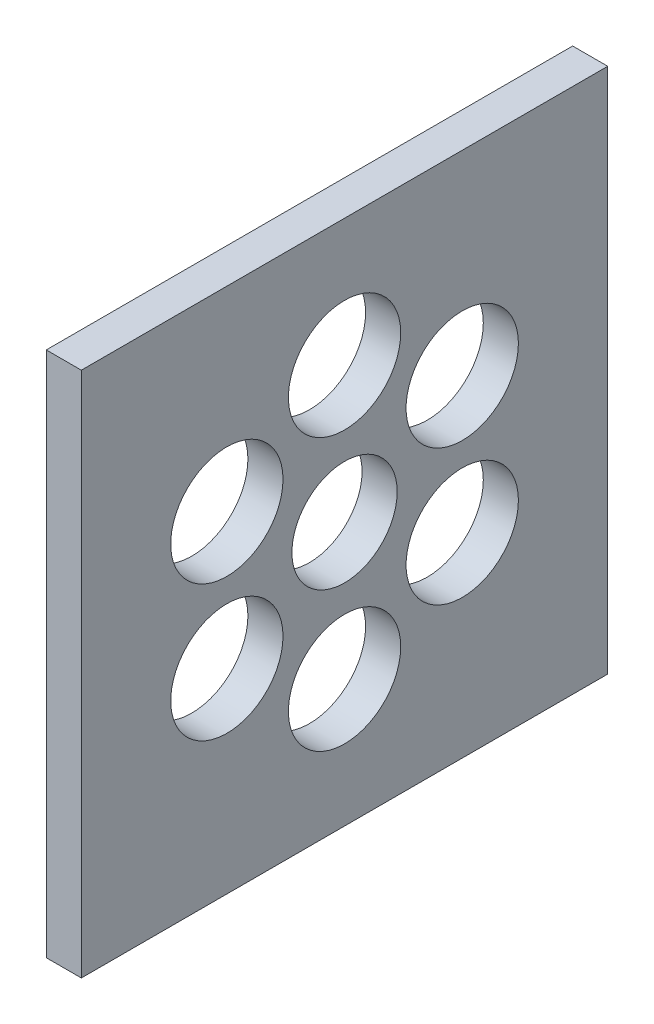
ISO-10303-21;
HEADER;
FILE_DESCRIPTION(('STEP AP214'),'2;1');
FILE_NAME('part.step','',(''),(''),'','','');
FILE_SCHEMA(('AUTOMOTIVE_DESIGN { 1 0 10303 214 1 1 1 1 }'));
ENDSEC;
DATA;
#1=APPLICATION_CONTEXT('core data for automotive mechanical design processes');
#2=APPLICATION_PROTOCOL_DEFINITION('international standard','automotive_design',2000,#1);
#3=PRODUCT_CONTEXT('',#1,'mechanical');
#4=PRODUCT('Part','Part','',(#3));
#5=PRODUCT_RELATED_PRODUCT_CATEGORY('part','',(#4));
#6=PRODUCT_DEFINITION_FORMATION('','',#4);
#7=PRODUCT_DEFINITION_CONTEXT('part definition',#1,'design');
#8=PRODUCT_DEFINITION('design','',#6,#7);
#9=PRODUCT_DEFINITION_SHAPE('','',#8);
#10=(LENGTH_UNIT() NAMED_UNIT(*) SI_UNIT(.MILLI.,.METRE.));
#11=(NAMED_UNIT(*) PLANE_ANGLE_UNIT() SI_UNIT($,.RADIAN.));
#12=(NAMED_UNIT(*) SI_UNIT($,.STERADIAN.) SOLID_ANGLE_UNIT());
#13=UNCERTAINTY_MEASURE_WITH_UNIT(LENGTH_MEASURE(1.E-05),#10,'distance_accuracy_value','');
#14=(GEOMETRIC_REPRESENTATION_CONTEXT(3) GLOBAL_UNCERTAINTY_ASSIGNED_CONTEXT((#13)) GLOBAL_UNIT_ASSIGNED_CONTEXT((#10,
#11,#12)) REPRESENTATION_CONTEXT('',''));
#15=CARTESIAN_POINT('',(0.,0.,0.));
#16=DIRECTION('',(0.,0.,1.));
#17=DIRECTION('',(1.,0.,0.));
#18=AXIS2_PLACEMENT_3D('',#15,#16,#17);
#19=CARTESIAN_POINT('',(10.,75.,-75.));
#20=DIRECTION('',(0.,0.,1.));
#21=DIRECTION('',(0.,-1.,0.));
#22=AXIS2_PLACEMENT_3D('',#19,#20,#21);
#23=PLANE('',#22);
#24=DIRECTION('',(0.,1.,0.));
#25=VECTOR('',#24,1.);
#26=CARTESIAN_POINT('',(0.,75.,-75.));
#27=LINE('',#26,#25);
#28=CARTESIAN_POINT('',(0.,-75.,-75.));
#29=VERTEX_POINT('',#28);
#30=CARTESIAN_POINT('',(0.,75.,-75.));
#31=VERTEX_POINT('',#30);
#32=EDGE_CURVE('E99',#29,#31,#27,.T.);
#33=ORIENTED_EDGE('',*,*,#32,.T.);
#34=DIRECTION('',(-1.,0.,0.));
#35=VECTOR('',#34,1.);
#36=CARTESIAN_POINT('',(10.,75.,-75.));
#37=LINE('',#36,#35);
#38=CARTESIAN_POINT('',(10.,75.,-75.));
#39=VERTEX_POINT('',#38);
#40=EDGE_CURVE('E11',#39,#31,#37,.T.);
#41=ORIENTED_EDGE('',*,*,#40,.F.);
#42=DIRECTION('',(0.,1.,0.));
#43=VECTOR('',#42,1.);
#44=CARTESIAN_POINT('',(10.,75.,-75.));
#45=LINE('',#44,#43);
#46=CARTESIAN_POINT('',(10.,-75.,-75.));
#47=VERTEX_POINT('',#46);
#48=EDGE_CURVE('E86',#47,#39,#45,.T.);
#49=ORIENTED_EDGE('',*,*,#48,.F.);
#50=DIRECTION('',(-1.,0.,0.));
#51=VECTOR('',#50,1.);
#52=CARTESIAN_POINT('',(10.,-75.,-75.));
#53=LINE('',#52,#51);
#54=EDGE_CURVE('E95',#47,#29,#53,.T.);
#55=ORIENTED_EDGE('',*,*,#54,.T.);
#56=EDGE_LOOP('',(#33,#41,#49,#55));
#57=FACE_BOUND('',#56,.T.);
#58=ADVANCED_FACE('F33',(#57),#23,.F.);
#59=CARTESIAN_POINT('',(10.,75.,75.));
#60=DIRECTION('',(0.,-1.,0.));
#61=DIRECTION('',(0.,0.,-1.));
#62=AXIS2_PLACEMENT_3D('',#59,#60,#61);
#63=PLANE('',#62);
#64=DIRECTION('',(0.,0.,1.));
#65=VECTOR('',#64,1.);
#66=CARTESIAN_POINT('',(0.,75.,75.));
#67=LINE('',#66,#65);
#68=CARTESIAN_POINT('',(0.,75.,75.));
#69=VERTEX_POINT('',#68);
#70=EDGE_CURVE('E90',#31,#69,#67,.T.);
#71=ORIENTED_EDGE('',*,*,#70,.T.);
#72=DIRECTION('',(-1.,0.,0.));
#73=VECTOR('',#72,1.);
#74=CARTESIAN_POINT('',(10.,75.,75.));
#75=LINE('',#74,#73);
#76=CARTESIAN_POINT('',(10.,75.,75.));
#77=VERTEX_POINT('',#76);
#78=EDGE_CURVE('E42',#77,#69,#75,.T.);
#79=ORIENTED_EDGE('',*,*,#78,.F.);
#80=DIRECTION('',(0.,0.,1.));
#81=VECTOR('',#80,1.);
#82=CARTESIAN_POINT('',(10.,75.,75.));
#83=LINE('',#82,#81);
#84=EDGE_CURVE('E81',#39,#77,#83,.T.);
#85=ORIENTED_EDGE('',*,*,#84,.F.);
#86=ORIENTED_EDGE('',*,*,#40,.T.);
#87=EDGE_LOOP('',(#71,#79,#85,#86));
#88=FACE_BOUND('',#87,.T.);
#89=ADVANCED_FACE('F89',(#88),#63,.F.);
#90=CARTESIAN_POINT('',(10.,75.,75.));
#91=DIRECTION('',(0.,0.,-1.));
#92=DIRECTION('',(0.,1.,0.));
#93=AXIS2_PLACEMENT_3D('',#90,#91,#92);
#94=PLANE('',#93);
#95=DIRECTION('',(0.,-1.,0.));
#96=VECTOR('',#95,1.);
#97=CARTESIAN_POINT('',(0.,75.,75.));
#98=LINE('',#97,#96);
#99=CARTESIAN_POINT('',(0.,-75.,75.));
#100=VERTEX_POINT('',#99);
#101=EDGE_CURVE('E68',#69,#100,#98,.T.);
#102=ORIENTED_EDGE('',*,*,#101,.T.);
#103=DIRECTION('',(-1.,0.,0.));
#104=VECTOR('',#103,1.);
#105=CARTESIAN_POINT('',(10.,-75.,75.));
#106=LINE('',#105,#104);
#107=CARTESIAN_POINT('',(10.,-75.,75.));
#108=VERTEX_POINT('',#107);
#109=EDGE_CURVE('E91',#108,#100,#106,.T.);
#110=ORIENTED_EDGE('',*,*,#109,.F.);
#111=DIRECTION('',(0.,-1.,0.));
#112=VECTOR('',#111,1.);
#113=CARTESIAN_POINT('',(10.,75.,75.));
#114=LINE('',#113,#112);
#115=EDGE_CURVE('E84',#77,#108,#114,.T.);
#116=ORIENTED_EDGE('',*,*,#115,.F.);
#117=ORIENTED_EDGE('',*,*,#78,.T.);
#118=EDGE_LOOP('',(#102,#110,#116,#117));
#119=FACE_BOUND('',#118,.T.);
#120=ADVANCED_FACE('F93',(#119),#94,.F.);
#121=CARTESIAN_POINT('',(10.,-75.,75.));
#122=DIRECTION('',(0.,1.,0.));
#123=DIRECTION('',(0.,0.,1.));
#124=AXIS2_PLACEMENT_3D('',#121,#122,#123);
#125=PLANE('',#124);
#126=DIRECTION('',(0.,0.,-1.));
#127=VECTOR('',#126,1.);
#128=CARTESIAN_POINT('',(0.,-75.,75.));
#129=LINE('',#128,#127);
#130=EDGE_CURVE('E74',#100,#29,#129,.T.);
#131=ORIENTED_EDGE('',*,*,#130,.T.);
#132=ORIENTED_EDGE('',*,*,#54,.F.);
#133=DIRECTION('',(0.,0.,-1.));
#134=VECTOR('',#133,1.);
#135=CARTESIAN_POINT('',(10.,-75.,75.));
#136=LINE('',#135,#134);
#137=EDGE_CURVE('E51',#108,#47,#136,.T.);
#138=ORIENTED_EDGE('',*,*,#137,.F.);
#139=ORIENTED_EDGE('',*,*,#109,.T.);
#140=EDGE_LOOP('',(#131,#132,#138,#139));
#141=FACE_BOUND('',#140,.T.);
#142=ADVANCED_FACE('F155',(#141),#125,.F.);
#143=CARTESIAN_POINT('',(10.,0.,0.));
#144=DIRECTION('',(1.,0.,0.));
#145=DIRECTION('',(0.,0.,-1.));
#146=AXIS2_PLACEMENT_3D('',#143,#144,#145);
#147=PLANE('',#146);
#148=CARTESIAN_POINT('',(10.,19.3638516580331,33.5391749019424));
#149=DIRECTION('',(1.,0.,0.));
#150=DIRECTION('',(0.,0.,-1.));
#151=AXIS2_PLACEMENT_3D('',#148,#149,#150);
#152=CIRCLE('',#151,16.0000000000021);
#153=CARTESIAN_POINT('',(10.,19.3638516580331,17.5391749019403));
#154=VERTEX_POINT('',#153);
#155=EDGE_CURVE('E138',#154,#154,#152,.T.);
#156=ORIENTED_EDGE('',*,*,#155,.F.);
#157=EDGE_LOOP('',(#156));
#158=FACE_BOUND('',#157,.T.);
#159=CARTESIAN_POINT('',(10.,-19.3638516580369,33.5391749019402));
#160=DIRECTION('',(1.,0.,0.));
#161=DIRECTION('',(0.,0.,-1.));
#162=AXIS2_PLACEMENT_3D('',#159,#160,#161);
#163=CIRCLE('',#162,16.0000000000041);
#164=CARTESIAN_POINT('',(10.,-19.3638516580369,17.5391749019361));
#165=VERTEX_POINT('',#164);
#166=EDGE_CURVE('E128',#165,#165,#163,.T.);
#167=ORIENTED_EDGE('',*,*,#166,.F.);
#168=EDGE_LOOP('',(#167));
#169=FACE_BOUND('',#168,.T.);
#170=CARTESIAN_POINT('',(10.,-38.72770331607,-4.39334457064407E-12));
#171=DIRECTION('',(1.,0.,0.));
#172=DIRECTION('',(0.,0.,-1.));
#173=AXIS2_PLACEMENT_3D('',#170,#171,#172);
#174=CIRCLE('',#173,16.0000000000045);
#175=CARTESIAN_POINT('',(10.,-38.72770331607,-16.0000000000089));
#176=VERTEX_POINT('',#175);
#177=EDGE_CURVE('E125',#176,#176,#174,.T.);
#178=ORIENTED_EDGE('',*,*,#177,.F.);
#179=EDGE_LOOP('',(#178));
#180=FACE_BOUND('',#179,.T.);
#181=CARTESIAN_POINT('',(10.,-19.3638516580331,-33.5391749019468));
#182=DIRECTION('',(1.,0.,0.));
#183=DIRECTION('',(0.,0.,-1.));
#184=AXIS2_PLACEMENT_3D('',#181,#182,#183);
#185=CIRCLE('',#184,16.0000000000028);
#186=CARTESIAN_POINT('',(10.,-19.3638516580331,-49.5391749019496));
#187=VERTEX_POINT('',#186);
#188=EDGE_CURVE('E122',#187,#187,#185,.T.);
#189=ORIENTED_EDGE('',*,*,#188,.F.);
#190=EDGE_LOOP('',(#189));
#191=FACE_BOUND('',#190,.T.);
#192=CARTESIAN_POINT('',(10.,19.3638516580369,-33.5391749019446));
#193=DIRECTION('',(1.,0.,0.));
#194=DIRECTION('',(0.,0.,-1.));
#195=AXIS2_PLACEMENT_3D('',#192,#193,#194);
#196=CIRCLE('',#195,16.0000000000006);
#197=CARTESIAN_POINT('',(10.,19.3638516580369,-49.5391749019451));
#198=VERTEX_POINT('',#197);
#199=EDGE_CURVE('E118',#198,#198,#196,.T.);
#200=ORIENTED_EDGE('',*,*,#199,.F.);
#201=EDGE_LOOP('',(#200));
#202=FACE_BOUND('',#201,.T.);
#203=CARTESIAN_POINT('',(10.,38.72770331607,0.));
#204=DIRECTION('',(1.,0.,0.));
#205=DIRECTION('',(0.,0.,-1.));
#206=AXIS2_PLACEMENT_3D('',#203,#204,#205);
#207=CIRCLE('',#206,16.);
#208=CARTESIAN_POINT('',(10.,38.72770331607,-16.));
#209=VERTEX_POINT('',#208);
#210=EDGE_CURVE('E114',#209,#209,#207,.T.);
#211=ORIENTED_EDGE('',*,*,#210,.F.);
#212=EDGE_LOOP('',(#211));
#213=FACE_BOUND('',#212,.T.);
#214=CARTESIAN_POINT('',(10.,0.,0.));
#215=DIRECTION('',(1.,0.,0.));
#216=DIRECTION('',(0.,0.,-1.));
#217=AXIS2_PLACEMENT_3D('',#214,#215,#216);
#218=CIRCLE('',#217,15.);
#219=CARTESIAN_POINT('',(10.,0.,-15.));
#220=VERTEX_POINT('',#219);
#221=EDGE_CURVE('E110',#220,#220,#218,.T.);
#222=ORIENTED_EDGE('',*,*,#221,.F.);
#223=EDGE_LOOP('',(#222));
#224=FACE_BOUND('',#223,.T.);
#225=ORIENTED_EDGE('',*,*,#48,.T.);
#226=ORIENTED_EDGE('',*,*,#84,.T.);
#227=ORIENTED_EDGE('',*,*,#115,.T.);
#228=ORIENTED_EDGE('',*,*,#137,.T.);
#229=EDGE_LOOP('',(#225,#226,#227,#228));
#230=FACE_BOUND('',#229,.T.);
#231=ADVANCED_FACE('F82',(#158,#169,#180,#191,#202,#213,#224,#230),#147,.T.);
#232=CARTESIAN_POINT('',(0.,0.,0.));
#233=DIRECTION('',(1.,0.,0.));
#234=DIRECTION('',(0.,0.,-1.));
#235=AXIS2_PLACEMENT_3D('',#232,#233,#234);
#236=PLANE('',#235);
#237=CARTESIAN_POINT('',(0.,19.3638516580331,33.5391749019424));
#238=DIRECTION('',(1.,0.,0.));
#239=DIRECTION('',(0.,0.,-1.));
#240=AXIS2_PLACEMENT_3D('',#237,#238,#239);
#241=CIRCLE('',#240,16.0000000000021);
#242=CARTESIAN_POINT('',(0.,19.3638516580331,17.5391749019403));
#243=VERTEX_POINT('',#242);
#244=EDGE_CURVE('E36',#243,#243,#241,.T.);
#245=ORIENTED_EDGE('',*,*,#244,.T.);
#246=EDGE_LOOP('',(#245));
#247=FACE_BOUND('',#246,.T.);
#248=CARTESIAN_POINT('',(0.,-19.3638516580369,33.5391749019402));
#249=DIRECTION('',(1.,0.,0.));
#250=DIRECTION('',(0.,0.,-1.));
#251=AXIS2_PLACEMENT_3D('',#248,#249,#250);
#252=CIRCLE('',#251,16.0000000000041);
#253=CARTESIAN_POINT('',(0.,-19.3638516580369,17.5391749019361));
#254=VERTEX_POINT('',#253);
#255=EDGE_CURVE('E126',#254,#254,#252,.T.);
#256=ORIENTED_EDGE('',*,*,#255,.T.);
#257=EDGE_LOOP('',(#256));
#258=FACE_BOUND('',#257,.T.);
#259=CARTESIAN_POINT('',(0.,-38.72770331607,-4.39334457064407E-12));
#260=DIRECTION('',(1.,0.,0.));
#261=DIRECTION('',(0.,0.,-1.));
#262=AXIS2_PLACEMENT_3D('',#259,#260,#261);
#263=CIRCLE('',#262,16.0000000000045);
#264=CARTESIAN_POINT('',(0.,-38.72770331607,-16.0000000000089));
#265=VERTEX_POINT('',#264);
#266=EDGE_CURVE('E123',#265,#265,#263,.T.);
#267=ORIENTED_EDGE('',*,*,#266,.T.);
#268=EDGE_LOOP('',(#267));
#269=FACE_BOUND('',#268,.T.);
#270=CARTESIAN_POINT('',(0.,-19.3638516580331,-33.5391749019468));
#271=DIRECTION('',(1.,0.,0.));
#272=DIRECTION('',(0.,0.,-1.));
#273=AXIS2_PLACEMENT_3D('',#270,#271,#272);
#274=CIRCLE('',#273,16.0000000000028);
#275=CARTESIAN_POINT('',(0.,-19.3638516580331,-49.5391749019496));
#276=VERTEX_POINT('',#275);
#277=EDGE_CURVE('E119',#276,#276,#274,.T.);
#278=ORIENTED_EDGE('',*,*,#277,.T.);
#279=EDGE_LOOP('',(#278));
#280=FACE_BOUND('',#279,.T.);
#281=CARTESIAN_POINT('',(0.,19.3638516580369,-33.5391749019446));
#282=DIRECTION('',(1.,0.,0.));
#283=DIRECTION('',(0.,0.,-1.));
#284=AXIS2_PLACEMENT_3D('',#281,#282,#283);
#285=CIRCLE('',#284,16.0000000000006);
#286=CARTESIAN_POINT('',(0.,19.3638516580369,-49.5391749019451));
#287=VERTEX_POINT('',#286);
#288=EDGE_CURVE('E115',#287,#287,#285,.T.);
#289=ORIENTED_EDGE('',*,*,#288,.T.);
#290=EDGE_LOOP('',(#289));
#291=FACE_BOUND('',#290,.T.);
#292=CARTESIAN_POINT('',(0.,38.72770331607,0.));
#293=DIRECTION('',(1.,0.,0.));
#294=DIRECTION('',(0.,0.,-1.));
#295=AXIS2_PLACEMENT_3D('',#292,#293,#294);
#296=CIRCLE('',#295,16.);
#297=CARTESIAN_POINT('',(0.,38.72770331607,-16.));
#298=VERTEX_POINT('',#297);
#299=EDGE_CURVE('E111',#298,#298,#296,.T.);
#300=ORIENTED_EDGE('',*,*,#299,.T.);
#301=EDGE_LOOP('',(#300));
#302=FACE_BOUND('',#301,.T.);
#303=CARTESIAN_POINT('',(0.,0.,0.));
#304=DIRECTION('',(1.,0.,0.));
#305=DIRECTION('',(0.,0.,-1.));
#306=AXIS2_PLACEMENT_3D('',#303,#304,#305);
#307=CIRCLE('',#306,15.);
#308=CARTESIAN_POINT('',(0.,0.,-15.));
#309=VERTEX_POINT('',#308);
#310=EDGE_CURVE('E102',#309,#309,#307,.T.);
#311=ORIENTED_EDGE('',*,*,#310,.T.);
#312=EDGE_LOOP('',(#311));
#313=FACE_BOUND('',#312,.T.);
#314=ORIENTED_EDGE('',*,*,#32,.F.);
#315=ORIENTED_EDGE('',*,*,#130,.F.);
#316=ORIENTED_EDGE('',*,*,#101,.F.);
#317=ORIENTED_EDGE('',*,*,#70,.F.);
#318=EDGE_LOOP('',(#314,#315,#316,#317));
#319=FACE_BOUND('',#318,.T.);
#320=ADVANCED_FACE('F154',(#247,#258,#269,#280,#291,#302,#313,#319),#236,.F.);
#321=CARTESIAN_POINT('',(-15.,0.,0.));
#322=DIRECTION('',(1.,0.,0.));
#323=DIRECTION('',(0.,0.,-1.));
#324=AXIS2_PLACEMENT_3D('',#321,#322,#323);
#325=CYLINDRICAL_SURFACE('',#324,15.);
#326=ORIENTED_EDGE('',*,*,#221,.T.);
#327=EDGE_LOOP('',(#326));
#328=FACE_BOUND('',#327,.T.);
#329=ORIENTED_EDGE('',*,*,#310,.F.);
#330=EDGE_LOOP('',(#329));
#331=FACE_BOUND('',#330,.T.);
#332=ADVANCED_FACE('F150',(#328,#331),#325,.F.);
#333=CARTESIAN_POINT('',(-15.,38.72770331607,0.));
#334=DIRECTION('',(1.,0.,0.));
#335=DIRECTION('',(0.,0.,-1.));
#336=AXIS2_PLACEMENT_3D('',#333,#334,#335);
#337=CYLINDRICAL_SURFACE('',#336,16.);
#338=ORIENTED_EDGE('',*,*,#210,.T.);
#339=EDGE_LOOP('',(#338));
#340=FACE_BOUND('',#339,.T.);
#341=ORIENTED_EDGE('',*,*,#299,.F.);
#342=EDGE_LOOP('',(#341));
#343=FACE_BOUND('',#342,.T.);
#344=ADVANCED_FACE('F204',(#340,#343),#337,.F.);
#345=CARTESIAN_POINT('',(-15.,19.3638516580369,-33.5391749019446));
#346=DIRECTION('',(1.,0.,0.));
#347=DIRECTION('',(0.,0.,-1.));
#348=AXIS2_PLACEMENT_3D('',#345,#346,#347);
#349=CYLINDRICAL_SURFACE('',#348,16.0000000000006);
#350=ORIENTED_EDGE('',*,*,#199,.T.);
#351=EDGE_LOOP('',(#350));
#352=FACE_BOUND('',#351,.T.);
#353=ORIENTED_EDGE('',*,*,#288,.F.);
#354=EDGE_LOOP('',(#353));
#355=FACE_BOUND('',#354,.T.);
#356=ADVANCED_FACE('F212',(#352,#355),#349,.F.);
#357=CARTESIAN_POINT('',(-15.,-19.3638516580331,-33.5391749019468));
#358=DIRECTION('',(1.,0.,0.));
#359=DIRECTION('',(0.,0.,-1.));
#360=AXIS2_PLACEMENT_3D('',#357,#358,#359);
#361=CYLINDRICAL_SURFACE('',#360,16.0000000000028);
#362=ORIENTED_EDGE('',*,*,#188,.T.);
#363=EDGE_LOOP('',(#362));
#364=FACE_BOUND('',#363,.T.);
#365=ORIENTED_EDGE('',*,*,#277,.F.);
#366=EDGE_LOOP('',(#365));
#367=FACE_BOUND('',#366,.T.);
#368=ADVANCED_FACE('F222',(#364,#367),#361,.F.);
#369=CARTESIAN_POINT('',(-15.,-38.72770331607,-4.39334457064407E-12));
#370=DIRECTION('',(1.,0.,0.));
#371=DIRECTION('',(0.,0.,-1.));
#372=AXIS2_PLACEMENT_3D('',#369,#370,#371);
#373=CYLINDRICAL_SURFACE('',#372,16.0000000000045);
#374=ORIENTED_EDGE('',*,*,#177,.T.);
#375=EDGE_LOOP('',(#374));
#376=FACE_BOUND('',#375,.T.);
#377=ORIENTED_EDGE('',*,*,#266,.F.);
#378=EDGE_LOOP('',(#377));
#379=FACE_BOUND('',#378,.T.);
#380=ADVANCED_FACE('F232',(#376,#379),#373,.F.);
#381=CARTESIAN_POINT('',(-15.,-19.3638516580369,33.5391749019402));
#382=DIRECTION('',(1.,0.,0.));
#383=DIRECTION('',(0.,0.,-1.));
#384=AXIS2_PLACEMENT_3D('',#381,#382,#383);
#385=CYLINDRICAL_SURFACE('',#384,16.0000000000041);
#386=ORIENTED_EDGE('',*,*,#166,.T.);
#387=EDGE_LOOP('',(#386));
#388=FACE_BOUND('',#387,.T.);
#389=ORIENTED_EDGE('',*,*,#255,.F.);
#390=EDGE_LOOP('',(#389));
#391=FACE_BOUND('',#390,.T.);
#392=ADVANCED_FACE('F242',(#388,#391),#385,.F.);
#393=CARTESIAN_POINT('',(-15.,19.3638516580331,33.5391749019424));
#394=DIRECTION('',(1.,0.,0.));
#395=DIRECTION('',(0.,0.,-1.));
#396=AXIS2_PLACEMENT_3D('',#393,#394,#395);
#397=CYLINDRICAL_SURFACE('',#396,16.0000000000021);
#398=ORIENTED_EDGE('',*,*,#155,.T.);
#399=EDGE_LOOP('',(#398));
#400=FACE_BOUND('',#399,.T.);
#401=ORIENTED_EDGE('',*,*,#244,.F.);
#402=EDGE_LOOP('',(#401));
#403=FACE_BOUND('',#402,.T.);
#404=ADVANCED_FACE('F252',(#400,#403),#397,.F.);
#405=CLOSED_SHELL('',(#58,#89,#120,#142,#231,#320,#332,#344,#356,#368,#380,#392,#404));
#406=MANIFOLD_SOLID_BREP('B2',#405);
#407=ADVANCED_BREP_SHAPE_REPRESENTATION('',(#18,#406),#14);
#408=SHAPE_DEFINITION_REPRESENTATION(#9,#407);
ENDSEC;
END-ISO-10303-21;
